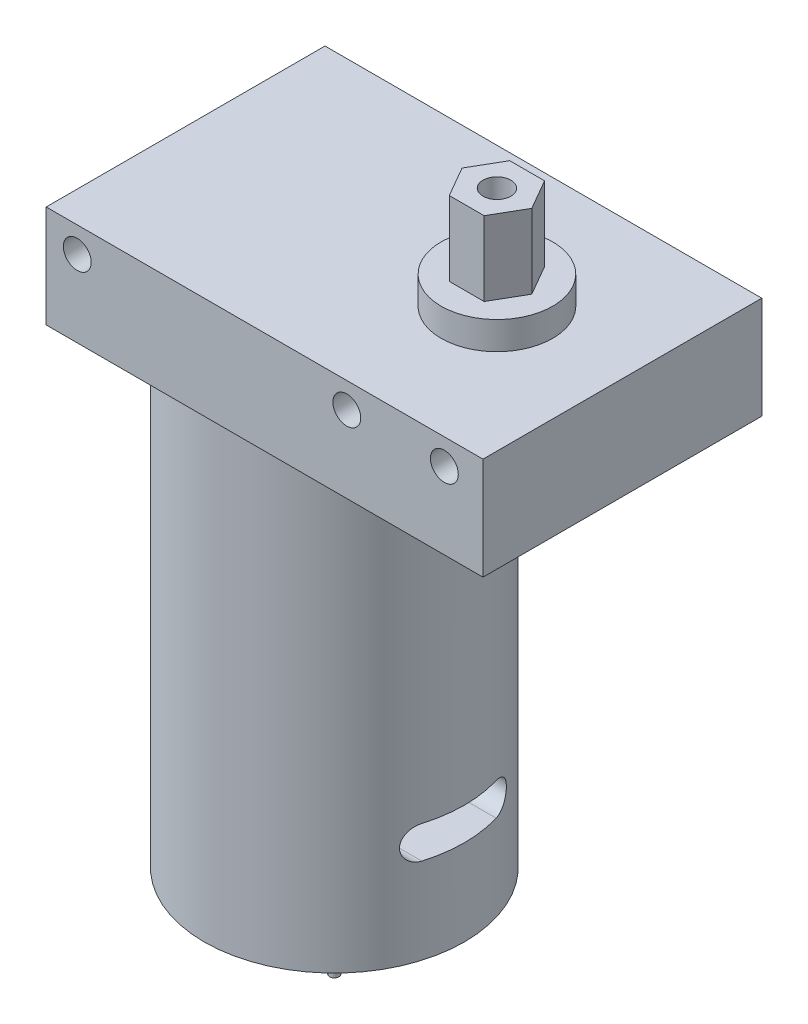
ISO-10303-21;
HEADER;
FILE_DESCRIPTION(('STEP AP214'),'2;1');
FILE_NAME('part.step','',(''),(''),'','','');
FILE_SCHEMA(('AUTOMOTIVE_DESIGN { 1 0 10303 214 1 1 1 1 }'));
ENDSEC;
DATA;
#1=APPLICATION_CONTEXT('core data for automotive mechanical design processes');
#2=APPLICATION_PROTOCOL_DEFINITION('international standard','automotive_design',2000,#1);
#3=PRODUCT_CONTEXT('',#1,'mechanical');
#4=PRODUCT('Part','Part','',(#3));
#5=PRODUCT_RELATED_PRODUCT_CATEGORY('part','',(#4));
#6=PRODUCT_DEFINITION_FORMATION('','',#4);
#7=PRODUCT_DEFINITION_CONTEXT('part definition',#1,'design');
#8=PRODUCT_DEFINITION('design','',#6,#7);
#9=PRODUCT_DEFINITION_SHAPE('','',#8);
#10=(LENGTH_UNIT() NAMED_UNIT(*) SI_UNIT(.MILLI.,.METRE.));
#11=(NAMED_UNIT(*) PLANE_ANGLE_UNIT() SI_UNIT($,.RADIAN.));
#12=(NAMED_UNIT(*) SI_UNIT($,.STERADIAN.) SOLID_ANGLE_UNIT());
#13=UNCERTAINTY_MEASURE_WITH_UNIT(LENGTH_MEASURE(1.E-05),#10,'distance_accuracy_value','');
#14=(GEOMETRIC_REPRESENTATION_CONTEXT(3) GLOBAL_UNCERTAINTY_ASSIGNED_CONTEXT((#13)) GLOBAL_UNIT_ASSIGNED_CONTEXT((#10,
#11,#12)) REPRESENTATION_CONTEXT('',''));
#15=CARTESIAN_POINT('',(0.,0.,0.));
#16=DIRECTION('',(0.,0.,1.));
#17=DIRECTION('',(1.,0.,0.));
#18=AXIS2_PLACEMENT_3D('',#15,#16,#17);
#19=CARTESIAN_POINT('',(16.,-52.,15.));
#20=DIRECTION('',(0.,-1.,0.));
#21=DIRECTION('',(0.,0.,-1.));
#22=AXIS2_PLACEMENT_3D('',#19,#20,#21);
#23=PLANE('',#22);
#24=CARTESIAN_POINT('',(16.,-52.,15.));
#25=DIRECTION('',(0.,-1.,0.));
#26=DIRECTION('',(0.,0.,-1.));
#27=AXIS2_PLACEMENT_3D('',#24,#25,#26);
#28=CIRCLE('',#27,5.);
#29=CARTESIAN_POINT('',(16.,-52.,10.));
#30=VERTEX_POINT('',#29);
#31=EDGE_CURVE('E248',#30,#30,#28,.T.);
#32=ORIENTED_EDGE('',*,*,#31,.T.);
#33=EDGE_LOOP('',(#32));
#34=FACE_BOUND('',#33,.T.);
#35=CARTESIAN_POINT('',(16.,-52.,15.));
#36=DIRECTION('',(0.,-1.,0.));
#37=DIRECTION('',(0.,0.,-1.));
#38=AXIS2_PLACEMENT_3D('',#35,#36,#37);
#39=CIRCLE('',#38,0.499999999999999);
#40=CARTESIAN_POINT('',(16.,-52.,14.5));
#41=VERTEX_POINT('',#40);
#42=EDGE_CURVE('E447',#41,#41,#39,.T.);
#43=ORIENTED_EDGE('',*,*,#42,.F.);
#44=EDGE_LOOP('',(#43));
#45=FACE_BOUND('',#44,.T.);
#46=ADVANCED_FACE('F48',(#34,#45),#23,.T.);
#47=CARTESIAN_POINT('',(16.,-50.,15.));
#48=DIRECTION('',(0.,-1.,0.));
#49=DIRECTION('',(0.,0.,-1.));
#50=AXIS2_PLACEMENT_3D('',#47,#48,#49);
#51=PLANE('',#50);
#52=CARTESIAN_POINT('',(16.,-50.,15.));
#53=DIRECTION('',(0.,-1.,0.));
#54=DIRECTION('',(0.,0.,-1.));
#55=AXIS2_PLACEMENT_3D('',#52,#53,#54);
#56=CIRCLE('',#55,14.);
#57=CARTESIAN_POINT('',(16.,-50.,0.999999999999999));
#58=VERTEX_POINT('',#57);
#59=EDGE_CURVE('E243',#58,#58,#56,.T.);
#60=ORIENTED_EDGE('',*,*,#59,.T.);
#61=EDGE_LOOP('',(#60));
#62=FACE_BOUND('',#61,.T.);
#63=CARTESIAN_POINT('',(16.,-50.,15.));
#64=DIRECTION('',(0.,-1.,0.));
#65=DIRECTION('',(0.,0.,-1.));
#66=AXIS2_PLACEMENT_3D('',#63,#64,#65);
#67=CIRCLE('',#66,5.);
#68=CARTESIAN_POINT('',(16.,-50.,10.));
#69=VERTEX_POINT('',#68);
#70=EDGE_CURVE('E246',#69,#69,#67,.T.);
#71=ORIENTED_EDGE('',*,*,#70,.F.);
#72=EDGE_LOOP('',(#71));
#73=FACE_BOUND('',#72,.T.);
#74=ADVANCED_FACE('F227',(#62,#73),#51,.T.);
#75=CARTESIAN_POINT('',(0.,0.,0.));
#76=DIRECTION('',(0.,1.,0.));
#77=DIRECTION('',(0.,0.,1.));
#78=AXIS2_PLACEMENT_3D('',#75,#76,#77);
#79=PLANE('',#78);
#80=DIRECTION('',(0.,0.,1.));
#81=VECTOR('',#80,1.);
#82=CARTESIAN_POINT('',(0.,0.,0.));
#83=LINE('',#82,#81);
#84=CARTESIAN_POINT('',(0.,0.,0.));
#85=VERTEX_POINT('',#84);
#86=CARTESIAN_POINT('',(0.,0.,30.));
#87=VERTEX_POINT('',#86);
#88=EDGE_CURVE('E306',#85,#87,#83,.T.);
#89=ORIENTED_EDGE('',*,*,#88,.F.);
#90=DIRECTION('',(-1.,0.,0.));
#91=VECTOR('',#90,1.);
#92=CARTESIAN_POINT('',(0.,0.,0.));
#93=LINE('',#92,#91);
#94=CARTESIAN_POINT('',(47.,0.,0.));
#95=VERTEX_POINT('',#94);
#96=EDGE_CURVE('E313',#95,#85,#93,.T.);
#97=ORIENTED_EDGE('',*,*,#96,.F.);
#98=DIRECTION('',(0.,0.,-1.));
#99=VECTOR('',#98,1.);
#100=CARTESIAN_POINT('',(47.,0.,0.));
#101=LINE('',#100,#99);
#102=CARTESIAN_POINT('',(47.,0.,30.));
#103=VERTEX_POINT('',#102);
#104=EDGE_CURVE('E324',#103,#95,#101,.T.);
#105=ORIENTED_EDGE('',*,*,#104,.F.);
#106=DIRECTION('',(1.,0.,0.));
#107=VECTOR('',#106,1.);
#108=CARTESIAN_POINT('',(0.,0.,30.));
#109=LINE('',#108,#107);
#110=EDGE_CURVE('E322',#87,#103,#109,.T.);
#111=ORIENTED_EDGE('',*,*,#110,.F.);
#112=EDGE_LOOP('',(#89,#97,#105,#111));
#113=FACE_BOUND('',#112,.T.);
#114=CARTESIAN_POINT('',(16.,0.,15.));
#115=DIRECTION('',(0.,1.,0.));
#116=DIRECTION('',(0.,0.,1.));
#117=AXIS2_PLACEMENT_3D('',#114,#115,#116);
#118=CIRCLE('',#117,14.);
#119=CARTESIAN_POINT('',(16.,0.,29.));
#120=VERTEX_POINT('',#119);
#121=EDGE_CURVE('E181',#120,#120,#118,.F.);
#122=ORIENTED_EDGE('',*,*,#121,.F.);
#123=EDGE_LOOP('',(#122));
#124=FACE_BOUND('',#123,.T.);
#125=ADVANCED_FACE('F232',(#113,#124),#79,.F.);
#126=CARTESIAN_POINT('',(33.5,14.,15.));
#127=DIRECTION('',(0.,1.,0.));
#128=DIRECTION('',(0.,0.,1.));
#129=AXIS2_PLACEMENT_3D('',#126,#127,#128);
#130=PLANE('',#129);
#131=CARTESIAN_POINT('',(33.5,14.,15.));
#132=DIRECTION('',(0.,1.,0.));
#133=DIRECTION('',(0.,0.,1.));
#134=AXIS2_PLACEMENT_3D('',#131,#132,#133);
#135=CIRCLE('',#134,5.99999999999999);
#136=CARTESIAN_POINT('',(33.5,14.,21.));
#137=VERTEX_POINT('',#136);
#138=EDGE_CURVE('E303',#137,#137,#135,.T.);
#139=ORIENTED_EDGE('',*,*,#138,.T.);
#140=EDGE_LOOP('',(#139));
#141=FACE_BOUND('',#140,.T.);
#142=DIRECTION('',(-0.5,0.,-0.866025403784438));
#143=VECTOR('',#142,1.);
#144=CARTESIAN_POINT('',(37.2527767497326,14.,15.));
#145=LINE('',#144,#143);
#146=CARTESIAN_POINT('',(37.2527767497326,14.,15.));
#147=VERTEX_POINT('',#146);
#148=CARTESIAN_POINT('',(35.3763883748663,14.,11.75));
#149=VERTEX_POINT('',#148);
#150=EDGE_CURVE('E277',#147,#149,#145,.T.);
#151=ORIENTED_EDGE('',*,*,#150,.F.);
#152=DIRECTION('',(0.5,0.,-0.866025403784439));
#153=VECTOR('',#152,1.);
#154=CARTESIAN_POINT('',(35.3763883748663,14.,18.25));
#155=LINE('',#154,#153);
#156=CARTESIAN_POINT('',(35.3763883748663,14.,18.25));
#157=VERTEX_POINT('',#156);
#158=EDGE_CURVE('E259',#157,#147,#155,.T.);
#159=ORIENTED_EDGE('',*,*,#158,.F.);
#160=DIRECTION('',(1.,0.,0.));
#161=VECTOR('',#160,1.);
#162=CARTESIAN_POINT('',(31.6236116251337,14.,18.25));
#163=LINE('',#162,#161);
#164=CARTESIAN_POINT('',(31.6236116251337,14.,18.25));
#165=VERTEX_POINT('',#164);
#166=EDGE_CURVE('E264',#165,#157,#163,.T.);
#167=ORIENTED_EDGE('',*,*,#166,.F.);
#168=DIRECTION('',(0.5,0.,0.866025403784438));
#169=VECTOR('',#168,1.);
#170=CARTESIAN_POINT('',(29.7472232502674,14.,15.));
#171=LINE('',#170,#169);
#172=CARTESIAN_POINT('',(29.7472232502674,14.,15.));
#173=VERTEX_POINT('',#172);
#174=EDGE_CURVE('E283',#173,#165,#171,.T.);
#175=ORIENTED_EDGE('',*,*,#174,.F.);
#176=DIRECTION('',(-0.5,0.,0.866025403784439));
#177=VECTOR('',#176,1.);
#178=CARTESIAN_POINT('',(31.6236116251337,14.,11.75));
#179=LINE('',#178,#177);
#180=CARTESIAN_POINT('',(31.6236116251337,14.,11.75));
#181=VERTEX_POINT('',#180);
#182=EDGE_CURVE('E281',#181,#173,#179,.T.);
#183=ORIENTED_EDGE('',*,*,#182,.F.);
#184=DIRECTION('',(-1.,0.,0.));
#185=VECTOR('',#184,1.);
#186=CARTESIAN_POINT('',(35.3763883748663,14.,11.75));
#187=LINE('',#186,#185);
#188=EDGE_CURVE('E279',#149,#181,#187,.T.);
#189=ORIENTED_EDGE('',*,*,#188,.F.);
#190=EDGE_LOOP('',(#151,#159,#167,#175,#183,#189));
#191=FACE_BOUND('',#190,.T.);
#192=ADVANCED_FACE('F237',(#141,#191),#130,.T.);
#193=CARTESIAN_POINT('',(0.,11.,0.));
#194=DIRECTION('',(0.,1.,0.));
#195=DIRECTION('',(0.,0.,1.));
#196=AXIS2_PLACEMENT_3D('',#193,#194,#195);
#197=PLANE('',#196);
#198=DIRECTION('',(0.,0.,1.));
#199=VECTOR('',#198,1.);
#200=CARTESIAN_POINT('',(0.,11.,0.));
#201=LINE('',#200,#199);
#202=CARTESIAN_POINT('',(0.,11.,0.));
#203=VERTEX_POINT('',#202);
#204=CARTESIAN_POINT('',(0.,11.,30.));
#205=VERTEX_POINT('',#204);
#206=EDGE_CURVE('E309',#203,#205,#201,.T.);
#207=ORIENTED_EDGE('',*,*,#206,.T.);
#208=DIRECTION('',(1.,0.,0.));
#209=VECTOR('',#208,1.);
#210=CARTESIAN_POINT('',(0.,11.,30.));
#211=LINE('',#210,#209);
#212=CARTESIAN_POINT('',(47.,11.,30.));
#213=VERTEX_POINT('',#212);
#214=EDGE_CURVE('E312',#205,#213,#211,.T.);
#215=ORIENTED_EDGE('',*,*,#214,.T.);
#216=DIRECTION('',(0.,0.,-1.));
#217=VECTOR('',#216,1.);
#218=CARTESIAN_POINT('',(47.,11.,0.));
#219=LINE('',#218,#217);
#220=CARTESIAN_POINT('',(47.,11.,0.));
#221=VERTEX_POINT('',#220);
#222=EDGE_CURVE('E315',#213,#221,#219,.T.);
#223=ORIENTED_EDGE('',*,*,#222,.T.);
#224=DIRECTION('',(-1.,0.,0.));
#225=VECTOR('',#224,1.);
#226=CARTESIAN_POINT('',(0.,11.,0.));
#227=LINE('',#226,#225);
#228=EDGE_CURVE('E317',#221,#203,#227,.T.);
#229=ORIENTED_EDGE('',*,*,#228,.T.);
#230=EDGE_LOOP('',(#207,#215,#223,#229));
#231=FACE_BOUND('',#230,.T.);
#232=CARTESIAN_POINT('',(33.5,11.,15.));
#233=DIRECTION('',(0.,1.,0.));
#234=DIRECTION('',(0.,0.,1.));
#235=AXIS2_PLACEMENT_3D('',#232,#233,#234);
#236=CIRCLE('',#235,5.99999999999999);
#237=CARTESIAN_POINT('',(33.5,11.,21.));
#238=VERTEX_POINT('',#237);
#239=EDGE_CURVE('E302',#238,#238,#236,.T.);
#240=ORIENTED_EDGE('',*,*,#239,.F.);
#241=EDGE_LOOP('',(#240));
#242=FACE_BOUND('',#241,.T.);
#243=ADVANCED_FACE('F379',(#231,#242),#197,.T.);
#244=CARTESIAN_POINT('',(0.,11.,0.));
#245=DIRECTION('',(1.,0.,0.));
#246=DIRECTION('',(0.,0.,-1.));
#247=AXIS2_PLACEMENT_3D('',#244,#245,#246);
#248=PLANE('',#247);
#249=ORIENTED_EDGE('',*,*,#88,.T.);
#250=DIRECTION('',(0.,-1.,0.));
#251=VECTOR('',#250,1.);
#252=CARTESIAN_POINT('',(0.,11.,30.));
#253=LINE('',#252,#251);
#254=EDGE_CURVE('E335',#205,#87,#253,.T.);
#255=ORIENTED_EDGE('',*,*,#254,.F.);
#256=ORIENTED_EDGE('',*,*,#206,.F.);
#257=DIRECTION('',(0.,-1.,0.));
#258=VECTOR('',#257,1.);
#259=CARTESIAN_POINT('',(0.,11.,0.));
#260=LINE('',#259,#258);
#261=EDGE_CURVE('E319',#203,#85,#260,.T.);
#262=ORIENTED_EDGE('',*,*,#261,.T.);
#263=EDGE_LOOP('',(#249,#255,#256,#262));
#264=FACE_BOUND('',#263,.T.);
#265=ADVANCED_FACE('F50',(#264),#248,.F.);
#266=CARTESIAN_POINT('',(0.,11.,30.));
#267=DIRECTION('',(0.,0.,-1.));
#268=DIRECTION('',(-1.,0.,0.));
#269=AXIS2_PLACEMENT_3D('',#266,#267,#268);
#270=PLANE('',#269);
#271=CARTESIAN_POINT('',(42.8407573826274,8.25,30.));
#272=DIRECTION('',(0.,0.,1.));
#273=DIRECTION('',(1.,0.,0.));
#274=AXIS2_PLACEMENT_3D('',#271,#272,#273);
#275=CIRCLE('',#274,1.5);
#276=CARTESIAN_POINT('',(44.3407573826274,8.25,30.));
#277=VERTEX_POINT('',#276);
#278=EDGE_CURVE('E404',#277,#277,#275,.T.);
#279=ORIENTED_EDGE('',*,*,#278,.F.);
#280=EDGE_LOOP('',(#279));
#281=FACE_BOUND('',#280,.T.);
#282=CARTESIAN_POINT('',(32.3407573826274,8.25,30.));
#283=DIRECTION('',(0.,0.,1.));
#284=DIRECTION('',(1.,0.,0.));
#285=AXIS2_PLACEMENT_3D('',#282,#283,#284);
#286=CIRCLE('',#285,1.5);
#287=CARTESIAN_POINT('',(33.8407573826274,8.25,30.));
#288=VERTEX_POINT('',#287);
#289=EDGE_CURVE('E408',#288,#288,#286,.T.);
#290=ORIENTED_EDGE('',*,*,#289,.F.);
#291=EDGE_LOOP('',(#290));
#292=FACE_BOUND('',#291,.T.);
#293=CARTESIAN_POINT('',(3.34075738262738,8.25,30.));
#294=DIRECTION('',(0.,0.,1.));
#295=DIRECTION('',(1.,0.,0.));
#296=AXIS2_PLACEMENT_3D('',#293,#294,#295);
#297=CIRCLE('',#296,1.5);
#298=CARTESIAN_POINT('',(4.84075738262738,8.25,30.));
#299=VERTEX_POINT('',#298);
#300=EDGE_CURVE('E254',#299,#299,#297,.T.);
#301=ORIENTED_EDGE('',*,*,#300,.F.);
#302=EDGE_LOOP('',(#301));
#303=FACE_BOUND('',#302,.T.);
#304=ORIENTED_EDGE('',*,*,#110,.T.);
#305=DIRECTION('',(0.,-1.,0.));
#306=VECTOR('',#305,1.);
#307=CARTESIAN_POINT('',(47.,11.,30.));
#308=LINE('',#307,#306);
#309=EDGE_CURVE('E332',#213,#103,#308,.T.);
#310=ORIENTED_EDGE('',*,*,#309,.F.);
#311=ORIENTED_EDGE('',*,*,#214,.F.);
#312=ORIENTED_EDGE('',*,*,#254,.T.);
#313=EDGE_LOOP('',(#304,#310,#311,#312));
#314=FACE_BOUND('',#313,.T.);
#315=ADVANCED_FACE('F393',(#281,#292,#303,#314),#270,.F.);
#316=CARTESIAN_POINT('',(47.,11.,0.));
#317=DIRECTION('',(-1.,0.,0.));
#318=DIRECTION('',(0.,0.,1.));
#319=AXIS2_PLACEMENT_3D('',#316,#317,#318);
#320=PLANE('',#319);
#321=ORIENTED_EDGE('',*,*,#104,.T.);
#322=DIRECTION('',(0.,-1.,0.));
#323=VECTOR('',#322,1.);
#324=CARTESIAN_POINT('',(47.,11.,0.));
#325=LINE('',#324,#323);
#326=EDGE_CURVE('E329',#221,#95,#325,.T.);
#327=ORIENTED_EDGE('',*,*,#326,.F.);
#328=ORIENTED_EDGE('',*,*,#222,.F.);
#329=ORIENTED_EDGE('',*,*,#309,.T.);
#330=EDGE_LOOP('',(#321,#327,#328,#329));
#331=FACE_BOUND('',#330,.T.);
#332=ADVANCED_FACE('F390',(#331),#320,.F.);
#333=CARTESIAN_POINT('',(0.,11.,0.));
#334=DIRECTION('',(0.,0.,1.));
#335=DIRECTION('',(1.,0.,0.));
#336=AXIS2_PLACEMENT_3D('',#333,#334,#335);
#337=PLANE('',#336);
#338=CARTESIAN_POINT('',(42.8407573826274,8.25,0.));
#339=DIRECTION('',(0.,0.,1.));
#340=DIRECTION('',(1.,0.,0.));
#341=AXIS2_PLACEMENT_3D('',#338,#339,#340);
#342=CIRCLE('',#341,1.5);
#343=CARTESIAN_POINT('',(44.3407573826274,8.25,0.));
#344=VERTEX_POINT('',#343);
#345=EDGE_CURVE('E431',#344,#344,#342,.T.);
#346=ORIENTED_EDGE('',*,*,#345,.T.);
#347=EDGE_LOOP('',(#346));
#348=FACE_BOUND('',#347,.T.);
#349=CARTESIAN_POINT('',(32.3407573826274,8.25,0.));
#350=DIRECTION('',(0.,0.,1.));
#351=DIRECTION('',(1.,0.,0.));
#352=AXIS2_PLACEMENT_3D('',#349,#350,#351);
#353=CIRCLE('',#352,1.5);
#354=CARTESIAN_POINT('',(33.8407573826274,8.25,0.));
#355=VERTEX_POINT('',#354);
#356=EDGE_CURVE('E427',#355,#355,#353,.T.);
#357=ORIENTED_EDGE('',*,*,#356,.T.);
#358=EDGE_LOOP('',(#357));
#359=FACE_BOUND('',#358,.T.);
#360=CARTESIAN_POINT('',(3.34075738262738,8.25,0.));
#361=DIRECTION('',(0.,0.,1.));
#362=DIRECTION('',(1.,0.,0.));
#363=AXIS2_PLACEMENT_3D('',#360,#361,#362);
#364=CIRCLE('',#363,1.5);
#365=CARTESIAN_POINT('',(4.84075738262738,8.25,0.));
#366=VERTEX_POINT('',#365);
#367=EDGE_CURVE('E249',#366,#366,#364,.T.);
#368=ORIENTED_EDGE('',*,*,#367,.T.);
#369=EDGE_LOOP('',(#368));
#370=FACE_BOUND('',#369,.T.);
#371=ORIENTED_EDGE('',*,*,#96,.T.);
#372=ORIENTED_EDGE('',*,*,#261,.F.);
#373=ORIENTED_EDGE('',*,*,#228,.F.);
#374=ORIENTED_EDGE('',*,*,#326,.T.);
#375=EDGE_LOOP('',(#371,#372,#373,#374));
#376=FACE_BOUND('',#375,.T.);
#377=ADVANCED_FACE('F383',(#348,#359,#370,#376),#337,.F.);
#378=CARTESIAN_POINT('',(33.5,14.,15.));
#379=DIRECTION('',(0.,-1.,0.));
#380=DIRECTION('',(0.,0.,-1.));
#381=AXIS2_PLACEMENT_3D('',#378,#379,#380);
#382=CYLINDRICAL_SURFACE('',#381,5.99999999999999);
#383=ORIENTED_EDGE('',*,*,#138,.F.);
#384=EDGE_LOOP('',(#383));
#385=FACE_BOUND('',#384,.T.);
#386=ORIENTED_EDGE('',*,*,#239,.T.);
#387=EDGE_LOOP('',(#386));
#388=FACE_BOUND('',#387,.T.);
#389=ADVANCED_FACE('F375',(#385,#388),#382,.T.);
#390=CARTESIAN_POINT('',(35.3763883748663,22.,18.25));
#391=DIRECTION('',(-0.866025403784439,0.,-0.5));
#392=DIRECTION('',(-0.5,0.,0.866025403784439));
#393=AXIS2_PLACEMENT_3D('',#390,#391,#392);
#394=PLANE('',#393);
#395=ORIENTED_EDGE('',*,*,#158,.T.);
#396=DIRECTION('',(0.,-1.,0.));
#397=VECTOR('',#396,1.);
#398=CARTESIAN_POINT('',(37.2527767497326,22.,15.));
#399=LINE('',#398,#397);
#400=CARTESIAN_POINT('',(37.2527767497326,22.,15.));
#401=VERTEX_POINT('',#400);
#402=EDGE_CURVE('E300',#401,#147,#399,.T.);
#403=ORIENTED_EDGE('',*,*,#402,.F.);
#404=DIRECTION('',(0.5,0.,-0.866025403784439));
#405=VECTOR('',#404,1.);
#406=CARTESIAN_POINT('',(35.3763883748663,22.,18.25));
#407=LINE('',#406,#405);
#408=CARTESIAN_POINT('',(35.3763883748663,22.,18.25));
#409=VERTEX_POINT('',#408);
#410=EDGE_CURVE('E260',#409,#401,#407,.T.);
#411=ORIENTED_EDGE('',*,*,#410,.F.);
#412=DIRECTION('',(0.,-1.,0.));
#413=VECTOR('',#412,1.);
#414=CARTESIAN_POINT('',(35.3763883748663,22.,18.25));
#415=LINE('',#414,#413);
#416=EDGE_CURVE('E274',#409,#157,#415,.T.);
#417=ORIENTED_EDGE('',*,*,#416,.T.);
#418=EDGE_LOOP('',(#395,#403,#411,#417));
#419=FACE_BOUND('',#418,.T.);
#420=ADVANCED_FACE('F371',(#419),#394,.F.);
#421=CARTESIAN_POINT('',(37.2527767497326,22.,15.));
#422=DIRECTION('',(-0.866025403784438,0.,0.5));
#423=DIRECTION('',(0.5,0.,0.866025403784439));
#424=AXIS2_PLACEMENT_3D('',#421,#422,#423);
#425=PLANE('',#424);
#426=ORIENTED_EDGE('',*,*,#150,.T.);
#427=DIRECTION('',(0.,-1.,0.));
#428=VECTOR('',#427,1.);
#429=CARTESIAN_POINT('',(35.3763883748663,22.,11.75));
#430=LINE('',#429,#428);
#431=CARTESIAN_POINT('',(35.3763883748663,22.,11.75));
#432=VERTEX_POINT('',#431);
#433=EDGE_CURVE('E297',#432,#149,#430,.T.);
#434=ORIENTED_EDGE('',*,*,#433,.F.);
#435=DIRECTION('',(-0.5,0.,-0.866025403784438));
#436=VECTOR('',#435,1.);
#437=CARTESIAN_POINT('',(37.2527767497326,22.,15.));
#438=LINE('',#437,#436);
#439=EDGE_CURVE('E263',#401,#432,#438,.T.);
#440=ORIENTED_EDGE('',*,*,#439,.F.);
#441=ORIENTED_EDGE('',*,*,#402,.T.);
#442=EDGE_LOOP('',(#426,#434,#440,#441));
#443=FACE_BOUND('',#442,.T.);
#444=ADVANCED_FACE('F367',(#443),#425,.F.);
#445=CARTESIAN_POINT('',(35.3763883748663,22.,11.75));
#446=DIRECTION('',(0.,0.,1.));
#447=DIRECTION('',(1.,0.,0.));
#448=AXIS2_PLACEMENT_3D('',#445,#446,#447);
#449=PLANE('',#448);
#450=ORIENTED_EDGE('',*,*,#188,.T.);
#451=DIRECTION('',(0.,-1.,0.));
#452=VECTOR('',#451,1.);
#453=CARTESIAN_POINT('',(31.6236116251337,22.,11.75));
#454=LINE('',#453,#452);
#455=CARTESIAN_POINT('',(31.6236116251337,22.,11.75));
#456=VERTEX_POINT('',#455);
#457=EDGE_CURVE('E294',#456,#181,#454,.T.);
#458=ORIENTED_EDGE('',*,*,#457,.F.);
#459=DIRECTION('',(-1.,0.,0.));
#460=VECTOR('',#459,1.);
#461=CARTESIAN_POINT('',(35.3763883748663,22.,11.75));
#462=LINE('',#461,#460);
#463=EDGE_CURVE('E266',#432,#456,#462,.T.);
#464=ORIENTED_EDGE('',*,*,#463,.F.);
#465=ORIENTED_EDGE('',*,*,#433,.T.);
#466=EDGE_LOOP('',(#450,#458,#464,#465));
#467=FACE_BOUND('',#466,.T.);
#468=ADVANCED_FACE('F363',(#467),#449,.F.);
#469=CARTESIAN_POINT('',(31.6236116251337,22.,11.75));
#470=DIRECTION('',(0.866025403784439,0.,0.5));
#471=DIRECTION('',(0.5,0.,-0.866025403784439));
#472=AXIS2_PLACEMENT_3D('',#469,#470,#471);
#473=PLANE('',#472);
#474=ORIENTED_EDGE('',*,*,#182,.T.);
#475=DIRECTION('',(0.,-1.,0.));
#476=VECTOR('',#475,1.);
#477=CARTESIAN_POINT('',(29.7472232502674,22.,15.));
#478=LINE('',#477,#476);
#479=CARTESIAN_POINT('',(29.7472232502674,22.,15.));
#480=VERTEX_POINT('',#479);
#481=EDGE_CURVE('E291',#480,#173,#478,.T.);
#482=ORIENTED_EDGE('',*,*,#481,.F.);
#483=DIRECTION('',(-0.5,0.,0.866025403784439));
#484=VECTOR('',#483,1.);
#485=CARTESIAN_POINT('',(31.6236116251337,22.,11.75));
#486=LINE('',#485,#484);
#487=EDGE_CURVE('E268',#456,#480,#486,.T.);
#488=ORIENTED_EDGE('',*,*,#487,.F.);
#489=ORIENTED_EDGE('',*,*,#457,.T.);
#490=EDGE_LOOP('',(#474,#482,#488,#489));
#491=FACE_BOUND('',#490,.T.);
#492=ADVANCED_FACE('F359',(#491),#473,.F.);
#493=CARTESIAN_POINT('',(29.7472232502674,22.,15.));
#494=DIRECTION('',(0.866025403784438,0.,-0.5));
#495=DIRECTION('',(-0.5,0.,-0.866025403784439));
#496=AXIS2_PLACEMENT_3D('',#493,#494,#495);
#497=PLANE('',#496);
#498=ORIENTED_EDGE('',*,*,#174,.T.);
#499=DIRECTION('',(0.,-1.,0.));
#500=VECTOR('',#499,1.);
#501=CARTESIAN_POINT('',(31.6236116251337,22.,18.25));
#502=LINE('',#501,#500);
#503=CARTESIAN_POINT('',(31.6236116251337,22.,18.25));
#504=VERTEX_POINT('',#503);
#505=EDGE_CURVE('E289',#504,#165,#502,.T.);
#506=ORIENTED_EDGE('',*,*,#505,.F.);
#507=DIRECTION('',(0.5,0.,0.866025403784438));
#508=VECTOR('',#507,1.);
#509=CARTESIAN_POINT('',(29.7472232502674,22.,15.));
#510=LINE('',#509,#508);
#511=EDGE_CURVE('E270',#480,#504,#510,.T.);
#512=ORIENTED_EDGE('',*,*,#511,.F.);
#513=ORIENTED_EDGE('',*,*,#481,.T.);
#514=EDGE_LOOP('',(#498,#506,#512,#513));
#515=FACE_BOUND('',#514,.T.);
#516=ADVANCED_FACE('F351',(#515),#497,.F.);
#517=CARTESIAN_POINT('',(31.6236116251337,22.,18.25));
#518=DIRECTION('',(0.,0.,-1.));
#519=DIRECTION('',(-1.,0.,0.));
#520=AXIS2_PLACEMENT_3D('',#517,#518,#519);
#521=PLANE('',#520);
#522=ORIENTED_EDGE('',*,*,#166,.T.);
#523=ORIENTED_EDGE('',*,*,#416,.F.);
#524=DIRECTION('',(1.,0.,0.));
#525=VECTOR('',#524,1.);
#526=CARTESIAN_POINT('',(31.6236116251337,22.,18.25));
#527=LINE('',#526,#525);
#528=EDGE_CURVE('E272',#504,#409,#527,.T.);
#529=ORIENTED_EDGE('',*,*,#528,.F.);
#530=ORIENTED_EDGE('',*,*,#505,.T.);
#531=EDGE_LOOP('',(#522,#523,#529,#530));
#532=FACE_BOUND('',#531,.T.);
#533=ADVANCED_FACE('F346',(#532),#521,.F.);
#534=CARTESIAN_POINT('',(0.,22.,0.));
#535=DIRECTION('',(0.,1.,0.));
#536=DIRECTION('',(0.,0.,1.));
#537=AXIS2_PLACEMENT_3D('',#534,#535,#536);
#538=PLANE('',#537);
#539=CARTESIAN_POINT('',(33.5,22.,15.));
#540=DIRECTION('',(0.,1.,0.));
#541=DIRECTION('',(0.,0.,1.));
#542=AXIS2_PLACEMENT_3D('',#539,#540,#541);
#543=CIRCLE('',#542,1.5);
#544=CARTESIAN_POINT('',(33.5,22.,16.5));
#545=VERTEX_POINT('',#544);
#546=EDGE_CURVE('E441',#545,#545,#543,.T.);
#547=ORIENTED_EDGE('',*,*,#546,.F.);
#548=EDGE_LOOP('',(#547));
#549=FACE_BOUND('',#548,.T.);
#550=ORIENTED_EDGE('',*,*,#410,.T.);
#551=ORIENTED_EDGE('',*,*,#439,.T.);
#552=ORIENTED_EDGE('',*,*,#463,.T.);
#553=ORIENTED_EDGE('',*,*,#487,.T.);
#554=ORIENTED_EDGE('',*,*,#511,.T.);
#555=ORIENTED_EDGE('',*,*,#528,.T.);
#556=EDGE_LOOP('',(#550,#551,#552,#553,#554,#555));
#557=FACE_BOUND('',#556,.T.);
#558=ADVANCED_FACE('F342',(#549,#557),#538,.T.);
#559=CARTESIAN_POINT('',(16.,-50.,15.));
#560=DIRECTION('',(0.,1.,0.));
#561=DIRECTION('',(0.,0.,1.));
#562=AXIS2_PLACEMENT_3D('',#559,#560,#561);
#563=CYLINDRICAL_SURFACE('',#562,14.);
#564=CARTESIAN_POINT('',(16.,-37.25,15.));
#565=DIRECTION('',(0.,1.,0.));
#566=DIRECTION('',(0.,0.,1.));
#567=AXIS2_PLACEMENT_3D('',#564,#565,#566);
#568=CIRCLE('',#567,14.);
#569=CARTESIAN_POINT('',(29.4164078649987,-37.25,19.));
#570=VERTEX_POINT('',#569);
#571=CARTESIAN_POINT('',(29.4164078649987,-37.25,11.));
#572=VERTEX_POINT('',#571);
#573=EDGE_CURVE('E62',#570,#572,#568,.T.);
#574=ORIENTED_EDGE('',*,*,#573,.T.);
#575=CARTESIAN_POINT('',(29.4164078649987,-37.25,11.));
#576=CARTESIAN_POINT('',(29.4009505736263,-37.2500013571118,10.9481484949685));
#577=CARTESIAN_POINT('',(29.3851973115395,-37.2523055307532,10.8964157711557));
#578=CARTESIAN_POINT('',(29.3532147991357,-37.2614565880063,10.793510955877));
#579=CARTESIAN_POINT('',(29.3369856267093,-37.2683027321719,10.7423387745314));
#580=CARTESIAN_POINT('',(29.2877938697727,-37.2955368395137,10.5902565545779));
#581=CARTESIAN_POINT('',(29.2542855074683,-37.3226208280629,10.4906418556386));
#582=CARTESIAN_POINT('',(29.1871085445877,-37.3937618037879,10.2978066692511));
#583=CARTESIAN_POINT('',(29.1534399584964,-37.4378172844213,10.2045856151103));
#584=CARTESIAN_POINT('',(29.0873160978216,-37.5418242311756,10.0269589491946));
#585=CARTESIAN_POINT('',(29.0548608734129,-37.6017763538264,9.94255370171244));
#586=CARTESIAN_POINT('',(28.9927082129094,-37.7363129722698,9.78495172650631));
#587=CARTESIAN_POINT('',(28.9630137347517,-37.8109129018539,9.71176696745845));
#588=CARTESIAN_POINT('',(28.9081408210273,-37.9729763720471,9.57920123949276));
#589=CARTESIAN_POINT('',(28.8829612012622,-38.0604365285721,9.5198166497269));
#590=CARTESIAN_POINT('',(28.8400678609597,-38.2407905983935,9.42008464083569));
#591=CARTESIAN_POINT('',(28.8220214668572,-38.3331267782414,9.37887456115723));
#592=CARTESIAN_POINT('',(28.792856208973,-38.5244914044475,9.31280807060966));
#593=CARTESIAN_POINT('',(28.7817324365737,-38.6235150535723,9.28794007137376));
#594=CARTESIAN_POINT('',(28.7679141926918,-38.8165861443776,9.25712389021523));
#595=CARTESIAN_POINT('',(28.7645989858497,-38.910368367026,9.24978176852281));
#596=CARTESIAN_POINT('',(28.7648002145439,-39.0978786214009,9.25022794714364));
#597=CARTESIAN_POINT('',(28.7683149487971,-39.1916066608068,9.25801247952979));
#598=CARTESIAN_POINT('',(28.7816324505206,-39.3723670827669,9.28772240836042));
#599=CARTESIAN_POINT('',(28.7911738742804,-39.4595167756579,9.30906027865145));
#600=CARTESIAN_POINT('',(28.8156789258599,-39.6288527787751,9.36446234825145));
#601=CARTESIAN_POINT('',(28.8306432082558,-39.7110384884169,9.39852808391608));
#602=CARTESIAN_POINT('',(28.8657072862595,-39.8712045293316,9.47953086272761));
#603=CARTESIAN_POINT('',(28.8859627732998,-39.9489506995042,9.52686200562511));
#604=CARTESIAN_POINT('',(28.9302506270026,-40.0955071563769,9.63232964481147));
#605=CARTESIAN_POINT('',(28.9542839804562,-40.1643150997823,9.69046896495843));
#606=CARTESIAN_POINT('',(29.0069786357766,-40.2966622870333,9.82082906794614));
#607=CARTESIAN_POINT('',(29.0358537895784,-40.359387987224,9.89378938030897));
#608=CARTESIAN_POINT('',(29.0954064187095,-40.4718465493623,10.0485150622465));
#609=CARTESIAN_POINT('',(29.1260851400704,-40.5215702963118,10.1302865524754));
#610=CARTESIAN_POINT('',(29.1901069809206,-40.6098689206112,10.3063422686669));
#611=CARTESIAN_POINT('',(29.22349102076,-40.6474751239935,10.4010976432122));
#612=CARTESIAN_POINT('',(29.2896065183108,-40.7057035538527,10.595810720767));
#613=CARTESIAN_POINT('',(29.3223388898936,-40.7263514808374,10.695760306509));
#614=CARTESIAN_POINT('',(29.3647670860905,-40.7421087531431,10.8305561176962));
#615=CARTESIAN_POINT('',(29.3752648014799,-40.7450661787456,10.8643557979106));
#616=CARTESIAN_POINT('',(29.3960189922165,-40.7490093996228,10.9320861901119));
#617=CARTESIAN_POINT('',(29.4062758160628,-40.7499982419191,10.9660166180242));
#618=CARTESIAN_POINT('',(29.4164078649987,-40.75,11.));
#619=B_SPLINE_CURVE_WITH_KNOTS('',3,(#575,#576,#577,#578,#579,#580,#581,#582,#583,#584,#585,
#586,#587,#588,#589,#590,#591,#592,#593,#594,#595,#596,#597,#598,#599,#600,#601,#602,#603,#604,
#605,#606,#607,#608,#609,#610,#611,#612,#613,#614,#615,#616,#617,#618),.UNSPECIFIED.,.F.,.F.,(4,
2,2,2,2,2,2,2,2,2,2,2,2,2,2,2,2,2,2,2,2,4),(0.,0.162213269936145,0.324400137557104,
0.648344274287916,0.972259661442537,1.29618842835805,1.62046035516602,1.94464710415035,
2.25112638604724,2.55738810459366,2.83833541570881,3.11921275409341,3.38867553347052,
3.65817084968474,3.93672331399788,4.21534865840365,4.51542624864582,4.81571364717901,
5.13609483521936,5.45598958039699,5.56249570636635,5.66883685095987),.UNSPECIFIED.);
#620=CARTESIAN_POINT('',(29.4164078649987,-40.75,11.));
#621=VERTEX_POINT('',#620);
#622=EDGE_CURVE('E13',#572,#621,#619,.T.);
#623=ORIENTED_EDGE('',*,*,#622,.T.);
#624=CARTESIAN_POINT('',(16.,-40.75,15.));
#625=DIRECTION('',(0.,-1.,0.));
#626=DIRECTION('',(0.,0.,-1.));
#627=AXIS2_PLACEMENT_3D('',#624,#625,#626);
#628=CIRCLE('',#627,14.);
#629=CARTESIAN_POINT('',(29.4164078649987,-40.75,19.));
#630=VERTEX_POINT('',#629);
#631=EDGE_CURVE('E152',#621,#630,#628,.T.);
#632=ORIENTED_EDGE('',*,*,#631,.T.);
#633=CARTESIAN_POINT('',(29.4164078649987,-40.75,19.));
#634=CARTESIAN_POINT('',(29.4009505736263,-40.7499986428882,19.0518515050315));
#635=CARTESIAN_POINT('',(29.3851973115395,-40.7476944692468,19.1035842288443));
#636=CARTESIAN_POINT('',(29.3532147991357,-40.7385434119937,19.206489044123));
#637=CARTESIAN_POINT('',(29.3369856267093,-40.7316972678281,19.2576612254686));
#638=CARTESIAN_POINT('',(29.2877938697727,-40.7044631604863,19.4097434454221));
#639=CARTESIAN_POINT('',(29.2542855074683,-40.6773791719372,19.5093581443614));
#640=CARTESIAN_POINT('',(29.1871085445877,-40.6062381962121,19.7021933307489));
#641=CARTESIAN_POINT('',(29.1534399584964,-40.5621827155787,19.7954143848897));
#642=CARTESIAN_POINT('',(29.0873160978216,-40.4581757688245,19.9730410508054));
#643=CARTESIAN_POINT('',(29.0548608734129,-40.3982236461737,20.0574462982876));
#644=CARTESIAN_POINT('',(28.9927082129094,-40.2636870277302,20.2150482734937));
#645=CARTESIAN_POINT('',(28.9630137347517,-40.1890870981461,20.2882330325415));
#646=CARTESIAN_POINT('',(28.9081408210273,-40.0270236279529,20.4207987605072));
#647=CARTESIAN_POINT('',(28.8829612012622,-39.9395634714279,20.4801833502731));
#648=CARTESIAN_POINT('',(28.8400678609597,-39.7592094016065,20.5799153591643));
#649=CARTESIAN_POINT('',(28.8220214668572,-39.6668732217586,20.6211254388428));
#650=CARTESIAN_POINT('',(28.792856208973,-39.4755085955525,20.6871919293903));
#651=CARTESIAN_POINT('',(28.7817324365737,-39.3764849464277,20.7120599286262));
#652=CARTESIAN_POINT('',(28.7679141926918,-39.1834138556224,20.7428761097848));
#653=CARTESIAN_POINT('',(28.7645989858497,-39.089631632974,20.7502182314772));
#654=CARTESIAN_POINT('',(28.7648002145439,-38.9021213785991,20.7497720528564));
#655=CARTESIAN_POINT('',(28.7683149487971,-38.8083933391932,20.7419875204702));
#656=CARTESIAN_POINT('',(28.7816324505206,-38.6276329172332,20.7122775916396));
#657=CARTESIAN_POINT('',(28.7911738742804,-38.5404832243421,20.6909397213485));
#658=CARTESIAN_POINT('',(28.8156789258599,-38.3711472212249,20.6355376517485));
#659=CARTESIAN_POINT('',(28.8306432082558,-38.2889615115832,20.6014719160839));
#660=CARTESIAN_POINT('',(28.8657072862595,-38.1287954706684,20.5204691372724));
#661=CARTESIAN_POINT('',(28.8859627732998,-38.0510493004958,20.4731379943749));
#662=CARTESIAN_POINT('',(28.9302506270026,-37.9044928436232,20.3676703551885));
#663=CARTESIAN_POINT('',(28.9542839804562,-37.8356849002177,20.3095310350416));
#664=CARTESIAN_POINT('',(29.0069786357766,-37.7033377129667,20.1791709320538));
#665=CARTESIAN_POINT('',(29.0358537895785,-37.640612012776,20.106210619691));
#666=CARTESIAN_POINT('',(29.0954064187095,-37.5281534506377,19.9514849377535));
#667=CARTESIAN_POINT('',(29.1260851400704,-37.4784297036882,19.8697134475246));
#668=CARTESIAN_POINT('',(29.1901069809206,-37.3901310793888,19.6936577313331));
#669=CARTESIAN_POINT('',(29.22349102076,-37.3525248760065,19.5989023567878));
#670=CARTESIAN_POINT('',(29.2896065183108,-37.2942964461473,19.4041892792329));
#671=CARTESIAN_POINT('',(29.3223388898936,-37.2736485191626,19.304239693491));
#672=CARTESIAN_POINT('',(29.3647670860905,-37.2578912468569,19.1694438823038));
#673=CARTESIAN_POINT('',(29.3752648014799,-37.2549338212544,19.1356442020894));
#674=CARTESIAN_POINT('',(29.3960189922165,-37.2509906003772,19.0679138098881));
#675=CARTESIAN_POINT('',(29.4062758160628,-37.2500017580809,19.0339833819758));
#676=CARTESIAN_POINT('',(29.4164078649987,-37.25,19.));
#677=B_SPLINE_CURVE_WITH_KNOTS('',3,(#633,#634,#635,#636,#637,#638,#639,#640,#641,#642,#643,
#644,#645,#646,#647,#648,#649,#650,#651,#652,#653,#654,#655,#656,#657,#658,#659,#660,#661,#662,
#663,#664,#665,#666,#667,#668,#669,#670,#671,#672,#673,#674,#675,#676),.UNSPECIFIED.,.F.,.F.,(4,
2,2,2,2,2,2,2,2,2,2,2,2,2,2,2,2,2,2,2,2,4),(0.,0.162213269936145,0.324400137557107,
0.648344274287922,0.972259661442547,1.29618842835806,1.62046035516602,1.94464710415035,
2.25112638604724,2.55738810459367,2.83833541570882,3.11921275409342,3.38867553347051,
3.65817084968475,3.93672331399789,4.21534865840366,4.51542624864583,4.81571364717902,
5.13609483521937,5.455989580397,5.56249570636635,5.66883685095987),.UNSPECIFIED.);
#678=EDGE_CURVE('E156',#630,#570,#677,.T.);
#679=ORIENTED_EDGE('',*,*,#678,.T.);
#680=EDGE_LOOP('',(#574,#623,#632,#679));
#681=FACE_BOUND('',#680,.T.);
#682=CARTESIAN_POINT('',(2.58359213500126,-40.75,19.));
#683=VERTEX_POINT('',#682);
#684=CARTESIAN_POINT('',(2.58359213500126,-40.75,11.));
#685=VERTEX_POINT('',#684);
#686=EDGE_CURVE('E159',#683,#685,#628,.T.);
#687=ORIENTED_EDGE('',*,*,#686,.T.);
#688=CARTESIAN_POINT('',(2.58359213500126,-40.75,11.));
#689=CARTESIAN_POINT('',(2.59904942637373,-40.7499986428882,10.9481484949685));
#690=CARTESIAN_POINT('',(2.61480268846053,-40.7476944692468,10.8964157711557));
#691=CARTESIAN_POINT('',(2.6467852008643,-40.7385434119937,10.793510955877));
#692=CARTESIAN_POINT('',(2.66301437329067,-40.7316972678281,10.7423387745314));
#693=CARTESIAN_POINT('',(2.71220613022727,-40.7044631604863,10.5902565545779));
#694=CARTESIAN_POINT('',(2.74571449253172,-40.6773791719372,10.4906418556386));
#695=CARTESIAN_POINT('',(2.81289145541228,-40.6062381962121,10.2978066692511));
#696=CARTESIAN_POINT('',(2.84656004150355,-40.5621827155787,10.2045856151103));
#697=CARTESIAN_POINT('',(2.91268390217843,-40.4581757688245,10.0269589491946));
#698=CARTESIAN_POINT('',(2.94513912658714,-40.3982236461737,9.94255370171245));
#699=CARTESIAN_POINT('',(3.00729178709057,-40.2636870277302,9.78495172650631));
#700=CARTESIAN_POINT('',(3.03698626524831,-40.1890870981461,9.71176696745846));
#701=CARTESIAN_POINT('',(3.09185917897273,-40.0270236279529,9.57920123949277));
#702=CARTESIAN_POINT('',(3.11703879873781,-39.9395634714279,9.51981664972691));
#703=CARTESIAN_POINT('',(3.15993213904033,-39.7592094016065,9.42008464083569));
#704=CARTESIAN_POINT('',(3.17797853314276,-39.6668732217586,9.37887456115723));
#705=CARTESIAN_POINT('',(3.20714379102703,-39.4755085955525,9.31280807060967));
#706=CARTESIAN_POINT('',(3.21826756342633,-39.3764849464277,9.28794007137376));
#707=CARTESIAN_POINT('',(3.23208580730823,-39.1834138556224,9.25712389021523));
#708=CARTESIAN_POINT('',(3.23540101415032,-39.089631632974,9.24978176852281));
#709=CARTESIAN_POINT('',(3.23519978545613,-38.9021213785991,9.25022794714364));
#710=CARTESIAN_POINT('',(3.23168505120289,-38.8083933391932,9.25801247952979));
#711=CARTESIAN_POINT('',(3.21836754947936,-38.6276329172332,9.28772240836042));
#712=CARTESIAN_POINT('',(3.20882612571964,-38.5404832243421,9.30906027865145));
#713=CARTESIAN_POINT('',(3.18432107414011,-38.3711472212249,9.36446234825146));
#714=CARTESIAN_POINT('',(3.16935679174424,-38.2889615115832,9.39852808391609));
#715=CARTESIAN_POINT('',(3.13429271374046,-38.1287954706684,9.47953086272761));
#716=CARTESIAN_POINT('',(3.1140372267002,-38.0510493004958,9.52686200562511));
#717=CARTESIAN_POINT('',(3.06974937299741,-37.9044928436232,9.63232964481147));
#718=CARTESIAN_POINT('',(3.04571601954377,-37.8356849002177,9.69046896495843));
#719=CARTESIAN_POINT('',(2.99302136422336,-37.7033377129667,9.82082906794614));
#720=CARTESIAN_POINT('',(2.96414621042155,-37.640612012776,9.89378938030897));
#721=CARTESIAN_POINT('',(2.90459358129052,-37.5281534506377,10.0485150622465));
#722=CARTESIAN_POINT('',(2.87391485992958,-37.4784297036882,10.1302865524754));
#723=CARTESIAN_POINT('',(2.80989301907936,-37.3901310793888,10.3063422686669));
#724=CARTESIAN_POINT('',(2.77650897924005,-37.3525248760065,10.4010976432122));
#725=CARTESIAN_POINT('',(2.71039348168924,-37.2942964461473,10.5958107207671));
#726=CARTESIAN_POINT('',(2.67766111010641,-37.2736485191626,10.695760306509));
#727=CARTESIAN_POINT('',(2.63523291390952,-37.2578912468569,10.8305561176962));
#728=CARTESIAN_POINT('',(2.62473519852007,-37.2549338212544,10.8643557979106));
#729=CARTESIAN_POINT('',(2.60398100778354,-37.2509906003772,10.9320861901119));
#730=CARTESIAN_POINT('',(2.59372418393721,-37.2500017580809,10.9660166180242));
#731=CARTESIAN_POINT('',(2.58359213500126,-37.25,11.));
#732=B_SPLINE_CURVE_WITH_KNOTS('',3,(#688,#689,#690,#691,#692,#693,#694,#695,#696,#697,#698,
#699,#700,#701,#702,#703,#704,#705,#706,#707,#708,#709,#710,#711,#712,#713,#714,#715,#716,#717,
#718,#719,#720,#721,#722,#723,#724,#725,#726,#727,#728,#729,#730,#731),.UNSPECIFIED.,.F.,.F.,(4,
2,2,2,2,2,2,2,2,2,2,2,2,2,2,2,2,2,2,2,2,4),(0.,0.162213269936145,0.324400137557103,
0.648344274287918,0.97225966144254,1.29618842835805,1.62046035516602,1.94464710415035,
2.25112638604724,2.55738810459366,2.83833541570881,3.11921275409341,3.38867553347052,
3.65817084968474,3.93672331399788,4.21534865840365,4.51542624864582,4.81571364717901,
5.13609483521936,5.45598958039699,5.56249570636635,5.66883685095987),.UNSPECIFIED.);
#733=CARTESIAN_POINT('',(2.58359213500126,-37.25,11.));
#734=VERTEX_POINT('',#733);
#735=EDGE_CURVE('E157',#685,#734,#732,.T.);
#736=ORIENTED_EDGE('',*,*,#735,.T.);
#737=CARTESIAN_POINT('',(2.58359213500126,-37.25,19.));
#738=VERTEX_POINT('',#737);
#739=EDGE_CURVE('E175',#734,#738,#568,.T.);
#740=ORIENTED_EDGE('',*,*,#739,.T.);
#741=CARTESIAN_POINT('',(2.58359213500126,-37.25,19.));
#742=CARTESIAN_POINT('',(2.59904942637373,-37.2500013571118,19.0518515050315));
#743=CARTESIAN_POINT('',(2.61480268846053,-37.2523055307532,19.1035842288443));
#744=CARTESIAN_POINT('',(2.6467852008643,-37.2614565880063,19.206489044123));
#745=CARTESIAN_POINT('',(2.66301437329067,-37.2683027321719,19.2576612254686));
#746=CARTESIAN_POINT('',(2.71220613022727,-37.2955368395137,19.4097434454221));
#747=CARTESIAN_POINT('',(2.74571449253172,-37.3226208280629,19.5093581443614));
#748=CARTESIAN_POINT('',(2.81289145541228,-37.3937618037879,19.7021933307489));
#749=CARTESIAN_POINT('',(2.84656004150355,-37.4378172844213,19.7954143848897));
#750=CARTESIAN_POINT('',(2.91268390217843,-37.5418242311756,19.9730410508054));
#751=CARTESIAN_POINT('',(2.94513912658714,-37.6017763538264,20.0574462982875));
#752=CARTESIAN_POINT('',(3.00729178709056,-37.7363129722698,20.2150482734937));
#753=CARTESIAN_POINT('',(3.03698626524831,-37.8109129018539,20.2882330325415));
#754=CARTESIAN_POINT('',(3.09185917897273,-37.9729763720471,20.4207987605072));
#755=CARTESIAN_POINT('',(3.11703879873781,-38.0604365285721,20.4801833502731));
#756=CARTESIAN_POINT('',(3.15993213904033,-38.2407905983935,20.5799153591643));
#757=CARTESIAN_POINT('',(3.17797853314276,-38.3331267782414,20.6211254388428));
#758=CARTESIAN_POINT('',(3.20714379102703,-38.5244914044475,20.6871919293903));
#759=CARTESIAN_POINT('',(3.21826756342633,-38.6235150535723,20.7120599286262));
#760=CARTESIAN_POINT('',(3.23208580730823,-38.8165861443776,20.7428761097848));
#761=CARTESIAN_POINT('',(3.23540101415032,-38.910368367026,20.7502182314772));
#762=CARTESIAN_POINT('',(3.23519978545613,-39.0978786214009,20.7497720528564));
#763=CARTESIAN_POINT('',(3.23168505120288,-39.1916066608068,20.7419875204702));
#764=CARTESIAN_POINT('',(3.21836754947936,-39.3723670827669,20.7122775916396));
#765=CARTESIAN_POINT('',(3.20882612571964,-39.4595167756579,20.6909397213485));
#766=CARTESIAN_POINT('',(3.18432107414011,-39.6288527787751,20.6355376517485));
#767=CARTESIAN_POINT('',(3.16935679174424,-39.7110384884169,20.6014719160839));
#768=CARTESIAN_POINT('',(3.13429271374046,-39.8712045293316,20.5204691372724));
#769=CARTESIAN_POINT('',(3.11403722670019,-39.9489506995042,20.4731379943749));
#770=CARTESIAN_POINT('',(3.06974937299741,-40.0955071563769,20.3676703551885));
#771=CARTESIAN_POINT('',(3.04571601954377,-40.1643150997823,20.3095310350416));
#772=CARTESIAN_POINT('',(2.99302136422336,-40.2966622870333,20.1791709320539));
#773=CARTESIAN_POINT('',(2.96414621042155,-40.359387987224,20.106210619691));
#774=CARTESIAN_POINT('',(2.90459358129052,-40.4718465493623,19.9514849377535));
#775=CARTESIAN_POINT('',(2.87391485992958,-40.5215702963118,19.8697134475246));
#776=CARTESIAN_POINT('',(2.80989301907936,-40.6098689206112,19.6936577313331));
#777=CARTESIAN_POINT('',(2.77650897924005,-40.6474751239935,19.5989023567878));
#778=CARTESIAN_POINT('',(2.71039348168924,-40.7057035538527,19.4041892792329));
#779=CARTESIAN_POINT('',(2.67766111010641,-40.7263514808374,19.304239693491));
#780=CARTESIAN_POINT('',(2.63523291390952,-40.7421087531431,19.1694438823038));
#781=CARTESIAN_POINT('',(2.62473519852007,-40.7450661787456,19.1356442020894));
#782=CARTESIAN_POINT('',(2.60398100778354,-40.7490093996228,19.0679138098881));
#783=CARTESIAN_POINT('',(2.59372418393721,-40.7499982419191,19.0339833819758));
#784=CARTESIAN_POINT('',(2.58359213500126,-40.75,19.));
#785=B_SPLINE_CURVE_WITH_KNOTS('',3,(#741,#742,#743,#744,#745,#746,#747,#748,#749,#750,#751,
#752,#753,#754,#755,#756,#757,#758,#759,#760,#761,#762,#763,#764,#765,#766,#767,#768,#769,#770,
#771,#772,#773,#774,#775,#776,#777,#778,#779,#780,#781,#782,#783,#784),.UNSPECIFIED.,.F.,.F.,(4,
2,2,2,2,2,2,2,2,2,2,2,2,2,2,2,2,2,2,2,2,4),(0.,0.162213269936141,0.3244001375571,
0.648344274287918,0.972259661442537,1.29618842835805,1.62046035516602,1.94464710415035,
2.25112638604723,2.55738810459366,2.83833541570882,3.11921275409341,3.38867553347052,
3.65817084968475,3.93672331399788,4.21534865840365,4.51542624864583,4.81571364717902,
5.13609483521936,5.45598958039699,5.56249570636636,5.66883685095988),.UNSPECIFIED.);
#786=EDGE_CURVE('E179',#738,#683,#785,.T.);
#787=ORIENTED_EDGE('',*,*,#786,.T.);
#788=EDGE_LOOP('',(#687,#736,#740,#787));
#789=FACE_BOUND('',#788,.T.);
#790=ORIENTED_EDGE('',*,*,#59,.F.);
#791=EDGE_LOOP('',(#790));
#792=FACE_BOUND('',#791,.T.);
#793=ORIENTED_EDGE('',*,*,#121,.T.);
#794=EDGE_LOOP('',(#793));
#795=FACE_BOUND('',#794,.T.);
#796=ADVANCED_FACE('F169',(#681,#789,#792,#795),#563,.T.);
#797=CARTESIAN_POINT('',(16.,-52.,15.));
#798=DIRECTION('',(0.,1.,0.));
#799=DIRECTION('',(0.,0.,1.));
#800=AXIS2_PLACEMENT_3D('',#797,#798,#799);
#801=CYLINDRICAL_SURFACE('',#800,5.);
#802=ORIENTED_EDGE('',*,*,#31,.F.);
#803=EDGE_LOOP('',(#802));
#804=FACE_BOUND('',#803,.T.);
#805=ORIENTED_EDGE('',*,*,#70,.T.);
#806=EDGE_LOOP('',(#805));
#807=FACE_BOUND('',#806,.T.);
#808=ADVANCED_FACE('F223',(#804,#807),#801,.T.);
#809=CARTESIAN_POINT('',(3.34075738262738,8.25,0.));
#810=DIRECTION('',(0.,0.,1.));
#811=DIRECTION('',(1.,0.,0.));
#812=AXIS2_PLACEMENT_3D('',#809,#810,#811);
#813=CYLINDRICAL_SURFACE('',#812,1.5);
#814=ORIENTED_EDGE('',*,*,#367,.F.);
#815=EDGE_LOOP('',(#814));
#816=FACE_BOUND('',#815,.T.);
#817=ORIENTED_EDGE('',*,*,#300,.T.);
#818=EDGE_LOOP('',(#817));
#819=FACE_BOUND('',#818,.T.);
#820=ADVANCED_FACE('F219',(#816,#819),#813,.F.);
#821=CARTESIAN_POINT('',(32.3407573826274,8.25,0.));
#822=DIRECTION('',(0.,0.,1.));
#823=DIRECTION('',(1.,0.,0.));
#824=AXIS2_PLACEMENT_3D('',#821,#822,#823);
#825=CYLINDRICAL_SURFACE('',#824,1.5);
#826=ORIENTED_EDGE('',*,*,#356,.F.);
#827=EDGE_LOOP('',(#826));
#828=FACE_BOUND('',#827,.T.);
#829=ORIENTED_EDGE('',*,*,#289,.T.);
#830=EDGE_LOOP('',(#829));
#831=FACE_BOUND('',#830,.T.);
#832=ADVANCED_FACE('F215',(#828,#831),#825,.F.);
#833=CARTESIAN_POINT('',(42.8407573826274,8.25,0.));
#834=DIRECTION('',(0.,0.,1.));
#835=DIRECTION('',(1.,0.,0.));
#836=AXIS2_PLACEMENT_3D('',#833,#834,#835);
#837=CYLINDRICAL_SURFACE('',#836,1.5);
#838=ORIENTED_EDGE('',*,*,#345,.F.);
#839=EDGE_LOOP('',(#838));
#840=FACE_BOUND('',#839,.T.);
#841=ORIENTED_EDGE('',*,*,#278,.T.);
#842=EDGE_LOOP('',(#841));
#843=FACE_BOUND('',#842,.T.);
#844=ADVANCED_FACE('F211',(#840,#843),#837,.F.);
#845=CARTESIAN_POINT('',(47.,-39.,11.));
#846=DIRECTION('',(-1.,0.,0.));
#847=DIRECTION('',(0.,0.,1.));
#848=AXIS2_PLACEMENT_3D('',#845,#846,#847);
#849=CYLINDRICAL_SURFACE('',#848,1.75);
#850=DIRECTION('',(-1.,0.,0.));
#851=VECTOR('',#850,1.);
#852=CARTESIAN_POINT('',(47.,-40.75,11.));
#853=LINE('',#852,#851);
#854=EDGE_CURVE('E74',#621,#685,#853,.T.);
#855=ORIENTED_EDGE('',*,*,#854,.F.);
#856=ORIENTED_EDGE('',*,*,#622,.F.);
#857=DIRECTION('',(-1.,0.,0.));
#858=VECTOR('',#857,1.);
#859=CARTESIAN_POINT('',(47.,-37.25,11.));
#860=LINE('',#859,#858);
#861=EDGE_CURVE('E434',#572,#734,#860,.T.);
#862=ORIENTED_EDGE('',*,*,#861,.T.);
#863=ORIENTED_EDGE('',*,*,#735,.F.);
#864=EDGE_LOOP('',(#855,#856,#862,#863));
#865=FACE_BOUND('',#864,.T.);
#866=ADVANCED_FACE('F161',(#865),#849,.F.);
#867=CARTESIAN_POINT('',(47.,-37.25,11.));
#868=DIRECTION('',(0.,1.,0.));
#869=DIRECTION('',(0.,0.,1.));
#870=AXIS2_PLACEMENT_3D('',#867,#868,#869);
#871=PLANE('',#870);
#872=DIRECTION('',(-1.,0.,0.));
#873=VECTOR('',#872,1.);
#874=CARTESIAN_POINT('',(47.,-37.25,19.));
#875=LINE('',#874,#873);
#876=EDGE_CURVE('E438',#570,#738,#875,.T.);
#877=ORIENTED_EDGE('',*,*,#876,.T.);
#878=ORIENTED_EDGE('',*,*,#739,.F.);
#879=ORIENTED_EDGE('',*,*,#861,.F.);
#880=ORIENTED_EDGE('',*,*,#573,.F.);
#881=EDGE_LOOP('',(#877,#878,#879,#880));
#882=FACE_BOUND('',#881,.T.);
#883=ADVANCED_FACE('F196',(#882),#871,.F.);
#884=CARTESIAN_POINT('',(47.,-39.,19.));
#885=DIRECTION('',(-1.,0.,0.));
#886=DIRECTION('',(0.,0.,1.));
#887=AXIS2_PLACEMENT_3D('',#884,#885,#886);
#888=CYLINDRICAL_SURFACE('',#887,1.75);
#889=ORIENTED_EDGE('',*,*,#876,.F.);
#890=ORIENTED_EDGE('',*,*,#678,.F.);
#891=DIRECTION('',(-1.,0.,0.));
#892=VECTOR('',#891,1.);
#893=CARTESIAN_POINT('',(47.,-40.75,19.));
#894=LINE('',#893,#892);
#895=EDGE_CURVE('E69',#630,#683,#894,.T.);
#896=ORIENTED_EDGE('',*,*,#895,.T.);
#897=ORIENTED_EDGE('',*,*,#786,.F.);
#898=EDGE_LOOP('',(#889,#890,#896,#897));
#899=FACE_BOUND('',#898,.T.);
#900=ADVANCED_FACE('F191',(#899),#888,.F.);
#901=CARTESIAN_POINT('',(47.,-40.75,11.));
#902=DIRECTION('',(0.,-1.,0.));
#903=DIRECTION('',(0.,0.,-1.));
#904=AXIS2_PLACEMENT_3D('',#901,#902,#903);
#905=PLANE('',#904);
#906=ORIENTED_EDGE('',*,*,#854,.T.);
#907=ORIENTED_EDGE('',*,*,#686,.F.);
#908=ORIENTED_EDGE('',*,*,#895,.F.);
#909=ORIENTED_EDGE('',*,*,#631,.F.);
#910=EDGE_LOOP('',(#906,#907,#908,#909));
#911=FACE_BOUND('',#910,.T.);
#912=ADVANCED_FACE('F153',(#911),#905,.F.);
#913=CARTESIAN_POINT('',(33.5,14.,15.));
#914=DIRECTION('',(0.,1.,0.));
#915=DIRECTION('',(0.,0.,1.));
#916=AXIS2_PLACEMENT_3D('',#913,#914,#915);
#917=CYLINDRICAL_SURFACE('',#916,1.5);
#918=CARTESIAN_POINT('',(33.5,14.,15.));
#919=DIRECTION('',(0.,1.,0.));
#920=DIRECTION('',(0.,0.,1.));
#921=AXIS2_PLACEMENT_3D('',#918,#919,#920);
#922=CIRCLE('',#921,1.5);
#923=CARTESIAN_POINT('',(33.5,14.,16.5));
#924=VERTEX_POINT('',#923);
#925=EDGE_CURVE('E166',#924,#924,#922,.T.);
#926=ORIENTED_EDGE('',*,*,#925,.F.);
#927=EDGE_LOOP('',(#926));
#928=FACE_BOUND('',#927,.T.);
#929=ORIENTED_EDGE('',*,*,#546,.T.);
#930=EDGE_LOOP('',(#929));
#931=FACE_BOUND('',#930,.T.);
#932=ADVANCED_FACE('F467',(#928,#931),#917,.F.);
#933=CARTESIAN_POINT('',(33.5,14.,15.));
#934=DIRECTION('',(0.,1.,0.));
#935=DIRECTION('',(0.,0.,1.));
#936=AXIS2_PLACEMENT_3D('',#933,#934,#935);
#937=PLANE('',#936);
#938=ORIENTED_EDGE('',*,*,#925,.T.);
#939=EDGE_LOOP('',(#938));
#940=FACE_BOUND('',#939,.T.);
#941=ADVANCED_FACE('F458',(#940),#937,.T.);
#942=CARTESIAN_POINT('',(16.,-60.,15.));
#943=DIRECTION('',(0.,1.,0.));
#944=DIRECTION('',(0.,0.,1.));
#945=AXIS2_PLACEMENT_3D('',#942,#943,#944);
#946=CYLINDRICAL_SURFACE('',#945,0.499999999999999);
#947=CARTESIAN_POINT('',(16.,-60.,15.));
#948=DIRECTION('',(0.,-1.,0.));
#949=DIRECTION('',(0.,0.,-1.));
#950=AXIS2_PLACEMENT_3D('',#947,#948,#949);
#951=CIRCLE('',#950,0.499999999999999);
#952=CARTESIAN_POINT('',(16.,-60.,14.5));
#953=VERTEX_POINT('',#952);
#954=EDGE_CURVE('E444',#953,#953,#951,.T.);
#955=ORIENTED_EDGE('',*,*,#954,.F.);
#956=EDGE_LOOP('',(#955));
#957=FACE_BOUND('',#956,.T.);
#958=ORIENTED_EDGE('',*,*,#42,.T.);
#959=EDGE_LOOP('',(#958));
#960=FACE_BOUND('',#959,.T.);
#961=ADVANCED_FACE('F455',(#957,#960),#946,.T.);
#962=CARTESIAN_POINT('',(16.,-60.,15.));
#963=DIRECTION('',(0.,-1.,0.));
#964=DIRECTION('',(0.,0.,-1.));
#965=AXIS2_PLACEMENT_3D('',#962,#963,#964);
#966=PLANE('',#965);
#967=ORIENTED_EDGE('',*,*,#954,.T.);
#968=EDGE_LOOP('',(#967));
#969=FACE_BOUND('',#968,.T.);
#970=ADVANCED_FACE('F453',(#969),#966,.T.);
#971=CLOSED_SHELL('',(#46,#74,#125,#192,#243,#265,#315,#332,#377,#389,#420,#444,#468,#492,#516,
#533,#558,#796,#808,#820,#832,#844,#866,#883,#900,#912,#932,#941,#961,#970));
#972=MANIFOLD_SOLID_BREP('B2',#971);
#973=ADVANCED_BREP_SHAPE_REPRESENTATION('',(#18,#972),#14);
#974=SHAPE_DEFINITION_REPRESENTATION(#9,#973);
ENDSEC;
END-ISO-10303-21;
